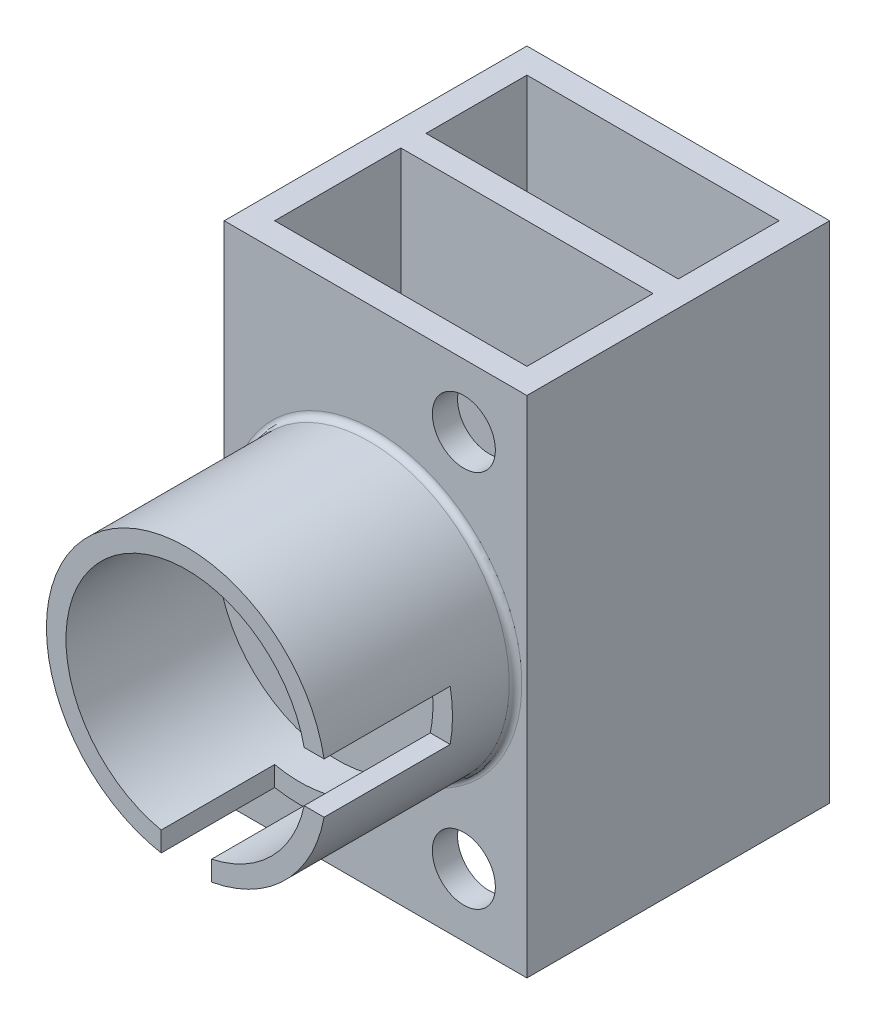
ISO-10303-21;
HEADER;
FILE_DESCRIPTION(('STEP AP214'),'2;1');
FILE_NAME('part.step','',(''),(''),'','','');
FILE_SCHEMA(('AUTOMOTIVE_DESIGN { 1 0 10303 214 1 1 1 1 }'));
ENDSEC;
DATA;
#1=APPLICATION_CONTEXT('core data for automotive mechanical design processes');
#2=APPLICATION_PROTOCOL_DEFINITION('international standard','automotive_design',2000,#1);
#3=PRODUCT_CONTEXT('',#1,'mechanical');
#4=PRODUCT('Part','Part','',(#3));
#5=PRODUCT_RELATED_PRODUCT_CATEGORY('part','',(#4));
#6=PRODUCT_DEFINITION_FORMATION('','',#4);
#7=PRODUCT_DEFINITION_CONTEXT('part definition',#1,'design');
#8=PRODUCT_DEFINITION('design','',#6,#7);
#9=PRODUCT_DEFINITION_SHAPE('','',#8);
#10=(LENGTH_UNIT() NAMED_UNIT(*) SI_UNIT(.MILLI.,.METRE.));
#11=(NAMED_UNIT(*) PLANE_ANGLE_UNIT() SI_UNIT($,.RADIAN.));
#12=(NAMED_UNIT(*) SI_UNIT($,.STERADIAN.) SOLID_ANGLE_UNIT());
#13=UNCERTAINTY_MEASURE_WITH_UNIT(LENGTH_MEASURE(1.E-05),#10,'distance_accuracy_value','');
#14=(GEOMETRIC_REPRESENTATION_CONTEXT(3) GLOBAL_UNCERTAINTY_ASSIGNED_CONTEXT((#13)) GLOBAL_UNIT_ASSIGNED_CONTEXT((#10,
#11,#12)) REPRESENTATION_CONTEXT('',''));
#15=CARTESIAN_POINT('',(0.,0.,0.));
#16=DIRECTION('',(0.,0.,1.));
#17=DIRECTION('',(1.,0.,0.));
#18=AXIS2_PLACEMENT_3D('',#15,#16,#17);
#19=CARTESIAN_POINT('',(0.,20.,27.));
#20=DIRECTION('',(0.,0.,-1.));
#21=DIRECTION('',(-1.,0.,0.));
#22=AXIS2_PLACEMENT_3D('',#19,#20,#21);
#23=CYLINDRICAL_SURFACE('',#22,11.1);
#24=CARTESIAN_POINT('',(0.,20.,12.5));
#25=DIRECTION('',(0.,0.,-1.));
#26=DIRECTION('',(-1.,0.,0.));
#27=AXIS2_PLACEMENT_3D('',#24,#25,#26);
#28=CIRCLE('',#27,11.1);
#29=CARTESIAN_POINT('',(-11.1,20.,12.5));
#30=VERTEX_POINT('',#29);
#31=EDGE_CURVE('E382',#30,#30,#28,.F.);
#32=ORIENTED_EDGE('',*,*,#31,.T.);
#33=EDGE_LOOP('',(#32));
#34=FACE_BOUND('',#33,.T.);
#35=CARTESIAN_POINT('',(0.,20.,18.));
#36=DIRECTION('',(0.,0.,1.));
#37=DIRECTION('',(1.,0.,0.));
#38=AXIS2_PLACEMENT_3D('',#35,#36,#37);
#39=CIRCLE('',#38,11.1);
#40=CARTESIAN_POINT('',(-2.,9.08166679387371,18.));
#41=VERTEX_POINT('',#40);
#42=CARTESIAN_POINT('',(2.,9.0816667938737,18.));
#43=VERTEX_POINT('',#42);
#44=EDGE_CURVE('E199',#41,#43,#39,.T.);
#45=ORIENTED_EDGE('',*,*,#44,.F.);
#46=DIRECTION('',(0.,0.,-1.));
#47=VECTOR('',#46,1.);
#48=CARTESIAN_POINT('',(-2.,9.08166679387371,27.));
#49=LINE('',#48,#47);
#50=CARTESIAN_POINT('',(-2.,9.08166679387371,27.));
#51=VERTEX_POINT('',#50);
#52=EDGE_CURVE('E190',#51,#41,#49,.T.);
#53=ORIENTED_EDGE('',*,*,#52,.F.);
#54=CARTESIAN_POINT('',(0.,20.,27.));
#55=DIRECTION('',(0.,0.,1.));
#56=DIRECTION('',(1.,0.,0.));
#57=AXIS2_PLACEMENT_3D('',#54,#55,#56);
#58=CIRCLE('',#57,11.1);
#59=CARTESIAN_POINT('',(10.9183332061263,22.,27.));
#60=VERTEX_POINT('',#59);
#61=EDGE_CURVE('E290',#60,#51,#58,.T.);
#62=ORIENTED_EDGE('',*,*,#61,.F.);
#63=DIRECTION('',(0.,0.,-1.));
#64=VECTOR('',#63,1.);
#65=CARTESIAN_POINT('',(10.9183332061263,22.,27.));
#66=LINE('',#65,#64);
#67=CARTESIAN_POINT('',(10.9183332061263,22.,17.));
#68=VERTEX_POINT('',#67);
#69=EDGE_CURVE('E244',#60,#68,#66,.T.);
#70=ORIENTED_EDGE('',*,*,#69,.T.);
#71=CARTESIAN_POINT('',(0.,20.,17.));
#72=DIRECTION('',(0.,0.,-1.));
#73=DIRECTION('',(-1.,0.,0.));
#74=AXIS2_PLACEMENT_3D('',#71,#72,#73);
#75=CIRCLE('',#74,11.1);
#76=CARTESIAN_POINT('',(10.9183332061263,18.,17.));
#77=VERTEX_POINT('',#76);
#78=EDGE_CURVE('E238',#68,#77,#75,.T.);
#79=ORIENTED_EDGE('',*,*,#78,.T.);
#80=DIRECTION('',(0.,0.,-1.));
#81=VECTOR('',#80,1.);
#82=CARTESIAN_POINT('',(10.9183332061263,18.,27.));
#83=LINE('',#82,#81);
#84=CARTESIAN_POINT('',(10.9183332061263,18.,27.));
#85=VERTEX_POINT('',#84);
#86=EDGE_CURVE('E234',#77,#85,#83,.F.);
#87=ORIENTED_EDGE('',*,*,#86,.T.);
#88=CARTESIAN_POINT('',(2.,9.08166679387371,27.));
#89=VERTEX_POINT('',#88);
#90=EDGE_CURVE('E285',#89,#85,#58,.T.);
#91=ORIENTED_EDGE('',*,*,#90,.F.);
#92=DIRECTION('',(0.,0.,-1.));
#93=VECTOR('',#92,1.);
#94=CARTESIAN_POINT('',(2.,9.08166679387371,27.));
#95=LINE('',#94,#93);
#96=EDGE_CURVE('E213',#43,#89,#95,.F.);
#97=ORIENTED_EDGE('',*,*,#96,.F.);
#98=EDGE_LOOP('',(#45,#53,#62,#70,#79,#87,#91,#97));
#99=FACE_BOUND('',#98,.T.);
#100=ADVANCED_FACE('F53',(#34,#99),#23,.T.);
#101=CARTESIAN_POINT('',(0.,20.,27.));
#102=DIRECTION('',(0.,0.,1.));
#103=DIRECTION('',(1.,0.,0.));
#104=AXIS2_PLACEMENT_3D('',#101,#102,#103);
#105=PLANE('',#104);
#106=CARTESIAN_POINT('',(0.,20.,27.));
#107=DIRECTION('',(0.,0.,1.));
#108=DIRECTION('',(1.,0.,0.));
#109=AXIS2_PLACEMENT_3D('',#106,#107,#108);
#110=CIRCLE('',#109,9.55);
#111=CARTESIAN_POINT('',(2.,10.6617721167236,27.));
#112=VERTEX_POINT('',#111);
#113=CARTESIAN_POINT('',(9.33822788327636,18.,27.));
#114=VERTEX_POINT('',#113);
#115=EDGE_CURVE('E269',#112,#114,#110,.T.);
#116=ORIENTED_EDGE('',*,*,#115,.F.);
#117=DIRECTION('',(0.,-1.,0.));
#118=VECTOR('',#117,1.);
#119=CARTESIAN_POINT('',(2.,20.,27.));
#120=LINE('',#119,#118);
#121=EDGE_CURVE('E215',#112,#89,#120,.T.);
#122=ORIENTED_EDGE('',*,*,#121,.T.);
#123=ORIENTED_EDGE('',*,*,#90,.T.);
#124=DIRECTION('',(1.,0.,0.));
#125=VECTOR('',#124,1.);
#126=CARTESIAN_POINT('',(0.,18.,27.));
#127=LINE('',#126,#125);
#128=EDGE_CURVE('E228',#114,#85,#127,.T.);
#129=ORIENTED_EDGE('',*,*,#128,.F.);
#130=EDGE_LOOP('',(#116,#122,#123,#129));
#131=FACE_BOUND('',#130,.T.);
#132=ADVANCED_FACE('F418',(#131),#105,.T.);
#133=ORIENTED_EDGE('',*,*,#61,.T.);
#134=DIRECTION('',(0.,1.,0.));
#135=VECTOR('',#134,1.);
#136=CARTESIAN_POINT('',(-2.,20.,27.));
#137=LINE('',#136,#135);
#138=CARTESIAN_POINT('',(-2.,10.6617721167236,27.));
#139=VERTEX_POINT('',#138);
#140=EDGE_CURVE('E193',#51,#139,#137,.T.);
#141=ORIENTED_EDGE('',*,*,#140,.T.);
#142=CARTESIAN_POINT('',(9.33822788327636,22.,27.));
#143=VERTEX_POINT('',#142);
#144=EDGE_CURVE('E286',#143,#139,#110,.T.);
#145=ORIENTED_EDGE('',*,*,#144,.F.);
#146=DIRECTION('',(-1.,0.,0.));
#147=VECTOR('',#146,1.);
#148=CARTESIAN_POINT('',(0.,22.,27.));
#149=LINE('',#148,#147);
#150=EDGE_CURVE('E241',#60,#143,#149,.T.);
#151=ORIENTED_EDGE('',*,*,#150,.F.);
#152=EDGE_LOOP('',(#133,#141,#145,#151));
#153=FACE_BOUND('',#152,.T.);
#154=ADVANCED_FACE('F426',(#153),#105,.T.);
#155=CARTESIAN_POINT('',(0.,20.,15.));
#156=DIRECTION('',(0.,0.,1.));
#157=DIRECTION('',(1.,0.,0.));
#158=AXIS2_PLACEMENT_3D('',#155,#156,#157);
#159=CYLINDRICAL_SURFACE('',#158,9.55);
#160=CARTESIAN_POINT('',(0.,20.,15.));
#161=DIRECTION('',(0.,0.,1.));
#162=DIRECTION('',(1.,0.,0.));
#163=AXIS2_PLACEMENT_3D('',#160,#161,#162);
#164=CIRCLE('',#163,9.55);
#165=CARTESIAN_POINT('',(9.55,20.,15.));
#166=VERTEX_POINT('',#165);
#167=EDGE_CURVE('E281',#166,#166,#164,.T.);
#168=ORIENTED_EDGE('',*,*,#167,.F.);
#169=EDGE_LOOP('',(#168));
#170=FACE_BOUND('',#169,.T.);
#171=DIRECTION('',(0.,0.,1.));
#172=VECTOR('',#171,1.);
#173=CARTESIAN_POINT('',(2.,10.6617721167236,15.));
#174=LINE('',#173,#172);
#175=CARTESIAN_POINT('',(2.,10.6617721167236,18.));
#176=VERTEX_POINT('',#175);
#177=EDGE_CURVE('E13',#112,#176,#174,.F.);
#178=ORIENTED_EDGE('',*,*,#177,.F.);
#179=ORIENTED_EDGE('',*,*,#115,.T.);
#180=DIRECTION('',(0.,0.,1.));
#181=VECTOR('',#180,1.);
#182=CARTESIAN_POINT('',(9.33822788327636,18.,15.));
#183=LINE('',#182,#181);
#184=CARTESIAN_POINT('',(9.33822788327636,18.,17.));
#185=VERTEX_POINT('',#184);
#186=EDGE_CURVE('E390',#114,#185,#183,.F.);
#187=ORIENTED_EDGE('',*,*,#186,.T.);
#188=CARTESIAN_POINT('',(0.,20.,17.));
#189=DIRECTION('',(0.,0.,-1.));
#190=DIRECTION('',(-1.,0.,0.));
#191=AXIS2_PLACEMENT_3D('',#188,#189,#190);
#192=CIRCLE('',#191,9.55);
#193=CARTESIAN_POINT('',(9.33822788327636,22.,17.));
#194=VERTEX_POINT('',#193);
#195=EDGE_CURVE('E394',#185,#194,#192,.F.);
#196=ORIENTED_EDGE('',*,*,#195,.T.);
#197=DIRECTION('',(0.,0.,1.));
#198=VECTOR('',#197,1.);
#199=CARTESIAN_POINT('',(9.33822788327636,22.,15.));
#200=LINE('',#199,#198);
#201=EDGE_CURVE('E398',#194,#143,#200,.T.);
#202=ORIENTED_EDGE('',*,*,#201,.T.);
#203=ORIENTED_EDGE('',*,*,#144,.T.);
#204=DIRECTION('',(0.,0.,1.));
#205=VECTOR('',#204,1.);
#206=CARTESIAN_POINT('',(-2.,10.6617721167236,15.));
#207=LINE('',#206,#205);
#208=CARTESIAN_POINT('',(-2.,10.6617721167236,18.));
#209=VERTEX_POINT('',#208);
#210=EDGE_CURVE('E402',#209,#139,#207,.T.);
#211=ORIENTED_EDGE('',*,*,#210,.F.);
#212=CARTESIAN_POINT('',(0.,20.,18.));
#213=DIRECTION('',(0.,0.,1.));
#214=DIRECTION('',(1.,0.,0.));
#215=AXIS2_PLACEMENT_3D('',#212,#213,#214);
#216=CIRCLE('',#215,9.55);
#217=EDGE_CURVE('E62',#176,#209,#216,.F.);
#218=ORIENTED_EDGE('',*,*,#217,.F.);
#219=EDGE_LOOP('',(#178,#179,#187,#196,#202,#203,#211,#218));
#220=FACE_BOUND('',#219,.T.);
#221=ADVANCED_FACE('F414',(#170,#220),#159,.F.);
#222=CARTESIAN_POINT('',(10.,40.,12.));
#223=DIRECTION('',(-1.,0.,0.));
#224=DIRECTION('',(0.,0.,1.));
#225=AXIS2_PLACEMENT_3D('',#222,#223,#224);
#226=PLANE('',#225);
#227=DIRECTION('',(0.,1.,0.));
#228=VECTOR('',#227,1.);
#229=CARTESIAN_POINT('',(10.,0.,-2.));
#230=LINE('',#229,#228);
#231=CARTESIAN_POINT('',(10.,0.,-2.));
#232=VERTEX_POINT('',#231);
#233=CARTESIAN_POINT('',(10.,40.,-2.));
#234=VERTEX_POINT('',#233);
#235=EDGE_CURVE('E270',#232,#234,#230,.T.);
#236=ORIENTED_EDGE('',*,*,#235,.T.);
#237=DIRECTION('',(0.,0.,-1.));
#238=VECTOR('',#237,1.);
#239=CARTESIAN_POINT('',(10.,40.,0.));
#240=LINE('',#239,#238);
#241=CARTESIAN_POINT('',(10.,40.,-10.));
#242=VERTEX_POINT('',#241);
#243=EDGE_CURVE('E320',#234,#242,#240,.T.);
#244=ORIENTED_EDGE('',*,*,#243,.T.);
#245=DIRECTION('',(0.,-1.,0.));
#246=VECTOR('',#245,1.);
#247=CARTESIAN_POINT('',(10.,40.,-10.));
#248=LINE('',#247,#246);
#249=CARTESIAN_POINT('',(10.,0.,-10.));
#250=VERTEX_POINT('',#249);
#251=EDGE_CURVE('E294',#242,#250,#248,.T.);
#252=ORIENTED_EDGE('',*,*,#251,.T.);
#253=DIRECTION('',(0.,0.,-1.));
#254=VECTOR('',#253,1.);
#255=CARTESIAN_POINT('',(10.,0.,0.));
#256=LINE('',#255,#254);
#257=EDGE_CURVE('E293',#232,#250,#256,.T.);
#258=ORIENTED_EDGE('',*,*,#257,.F.);
#259=EDGE_LOOP('',(#236,#244,#252,#258));
#260=FACE_BOUND('',#259,.T.);
#261=ADVANCED_FACE('F501',(#260),#226,.T.);
#262=CARTESIAN_POINT('',(-10.,40.,12.));
#263=DIRECTION('',(1.,0.,0.));
#264=DIRECTION('',(0.,0.,-1.));
#265=AXIS2_PLACEMENT_3D('',#262,#263,#264);
#266=PLANE('',#265);
#267=DIRECTION('',(0.,1.,0.));
#268=VECTOR('',#267,1.);
#269=CARTESIAN_POINT('',(-10.,0.,-2.));
#270=LINE('',#269,#268);
#271=CARTESIAN_POINT('',(-10.,0.,-2.));
#272=VERTEX_POINT('',#271);
#273=CARTESIAN_POINT('',(-10.,40.,-2.));
#274=VERTEX_POINT('',#273);
#275=EDGE_CURVE('E265',#272,#274,#270,.T.);
#276=ORIENTED_EDGE('',*,*,#275,.F.);
#277=DIRECTION('',(0.,0.,1.));
#278=VECTOR('',#277,1.);
#279=CARTESIAN_POINT('',(-10.,0.,0.));
#280=LINE('',#279,#278);
#281=CARTESIAN_POINT('',(-10.,0.,-10.));
#282=VERTEX_POINT('',#281);
#283=EDGE_CURVE('E321',#282,#272,#280,.T.);
#284=ORIENTED_EDGE('',*,*,#283,.F.);
#285=DIRECTION('',(0.,-1.,0.));
#286=VECTOR('',#285,1.);
#287=CARTESIAN_POINT('',(-10.,40.,-10.));
#288=LINE('',#287,#286);
#289=CARTESIAN_POINT('',(-10.,40.,-10.));
#290=VERTEX_POINT('',#289);
#291=EDGE_CURVE('E299',#290,#282,#288,.T.);
#292=ORIENTED_EDGE('',*,*,#291,.F.);
#293=DIRECTION('',(0.,0.,1.));
#294=VECTOR('',#293,1.);
#295=CARTESIAN_POINT('',(-10.,40.,0.));
#296=LINE('',#295,#294);
#297=EDGE_CURVE('E336',#290,#274,#296,.T.);
#298=ORIENTED_EDGE('',*,*,#297,.T.);
#299=EDGE_LOOP('',(#276,#284,#292,#298));
#300=FACE_BOUND('',#299,.T.);
#301=ADVANCED_FACE('F506',(#300),#266,.T.);
#302=CARTESIAN_POINT('',(0.,40.,0.));
#303=DIRECTION('',(0.,-1.,0.));
#304=DIRECTION('',(0.,0.,-1.));
#305=AXIS2_PLACEMENT_3D('',#302,#303,#304);
#306=PLANE('',#305);
#307=ORIENTED_EDGE('',*,*,#243,.F.);
#308=DIRECTION('',(-1.,0.,0.));
#309=VECTOR('',#308,1.);
#310=CARTESIAN_POINT('',(-10.,40.,-2.));
#311=LINE('',#310,#309);
#312=EDGE_CURVE('E254',#234,#274,#311,.T.);
#313=ORIENTED_EDGE('',*,*,#312,.T.);
#314=ORIENTED_EDGE('',*,*,#297,.F.);
#315=DIRECTION('',(-1.,0.,0.));
#316=VECTOR('',#315,1.);
#317=CARTESIAN_POINT('',(0.,40.,-10.));
#318=LINE('',#317,#316);
#319=EDGE_CURVE('E332',#242,#290,#318,.T.);
#320=ORIENTED_EDGE('',*,*,#319,.F.);
#321=EDGE_LOOP('',(#307,#313,#314,#320));
#322=FACE_BOUND('',#321,.T.);
#323=DIRECTION('',(0.,0.,-1.));
#324=VECTOR('',#323,1.);
#325=CARTESIAN_POINT('',(12.,40.,12.));
#326=LINE('',#325,#324);
#327=CARTESIAN_POINT('',(12.,40.,12.));
#328=VERTEX_POINT('',#327);
#329=CARTESIAN_POINT('',(12.,40.,-12.));
#330=VERTEX_POINT('',#329);
#331=EDGE_CURVE('E341',#328,#330,#326,.T.);
#332=ORIENTED_EDGE('',*,*,#331,.T.);
#333=DIRECTION('',(-1.,0.,0.));
#334=VECTOR('',#333,1.);
#335=CARTESIAN_POINT('',(-12.,40.,-12.));
#336=LINE('',#335,#334);
#337=CARTESIAN_POINT('',(-12.,40.,-12.));
#338=VERTEX_POINT('',#337);
#339=EDGE_CURVE('E345',#330,#338,#336,.T.);
#340=ORIENTED_EDGE('',*,*,#339,.T.);
#341=DIRECTION('',(0.,0.,1.));
#342=VECTOR('',#341,1.);
#343=CARTESIAN_POINT('',(-12.,40.,12.));
#344=LINE('',#343,#342);
#345=CARTESIAN_POINT('',(-12.,40.,12.));
#346=VERTEX_POINT('',#345);
#347=EDGE_CURVE('E349',#338,#346,#344,.T.);
#348=ORIENTED_EDGE('',*,*,#347,.T.);
#349=DIRECTION('',(1.,0.,0.));
#350=VECTOR('',#349,1.);
#351=CARTESIAN_POINT('',(-12.,40.,12.));
#352=LINE('',#351,#350);
#353=EDGE_CURVE('E352',#346,#328,#352,.T.);
#354=ORIENTED_EDGE('',*,*,#353,.T.);
#355=EDGE_LOOP('',(#332,#340,#348,#354));
#356=FACE_BOUND('',#355,.T.);
#357=CARTESIAN_POINT('',(10.,40.,10.));
#358=VERTEX_POINT('',#357);
#359=CARTESIAN_POINT('',(10.,40.,0.));
#360=VERTEX_POINT('',#359);
#361=EDGE_CURVE('E329',#358,#360,#240,.T.);
#362=ORIENTED_EDGE('',*,*,#361,.F.);
#363=DIRECTION('',(1.,0.,0.));
#364=VECTOR('',#363,1.);
#365=CARTESIAN_POINT('',(0.,40.,10.));
#366=LINE('',#365,#364);
#367=CARTESIAN_POINT('',(-10.,40.,10.));
#368=VERTEX_POINT('',#367);
#369=EDGE_CURVE('E304',#368,#358,#366,.T.);
#370=ORIENTED_EDGE('',*,*,#369,.F.);
#371=CARTESIAN_POINT('',(-10.,40.,0.));
#372=VERTEX_POINT('',#371);
#373=EDGE_CURVE('E335',#372,#368,#296,.T.);
#374=ORIENTED_EDGE('',*,*,#373,.F.);
#375=DIRECTION('',(1.,0.,0.));
#376=VECTOR('',#375,1.);
#377=CARTESIAN_POINT('',(-10.,40.,0.));
#378=LINE('',#377,#376);
#379=EDGE_CURVE('E248',#372,#360,#378,.T.);
#380=ORIENTED_EDGE('',*,*,#379,.T.);
#381=EDGE_LOOP('',(#362,#370,#374,#380));
#382=FACE_BOUND('',#381,.T.);
#383=ADVANCED_FACE('F471',(#322,#356,#382),#306,.F.);
#384=CARTESIAN_POINT('',(0.,0.,0.));
#385=DIRECTION('',(0.,-1.,0.));
#386=DIRECTION('',(0.,0.,-1.));
#387=AXIS2_PLACEMENT_3D('',#384,#385,#386);
#388=PLANE('',#387);
#389=DIRECTION('',(-1.,0.,0.));
#390=VECTOR('',#389,1.);
#391=CARTESIAN_POINT('',(-10.,0.,-2.));
#392=LINE('',#391,#390);
#393=EDGE_CURVE('E253',#232,#272,#392,.T.);
#394=ORIENTED_EDGE('',*,*,#393,.F.);
#395=ORIENTED_EDGE('',*,*,#257,.T.);
#396=DIRECTION('',(-1.,0.,0.));
#397=VECTOR('',#396,1.);
#398=CARTESIAN_POINT('',(0.,0.,-10.));
#399=LINE('',#398,#397);
#400=EDGE_CURVE('E315',#250,#282,#399,.T.);
#401=ORIENTED_EDGE('',*,*,#400,.T.);
#402=ORIENTED_EDGE('',*,*,#283,.T.);
#403=EDGE_LOOP('',(#394,#395,#401,#402));
#404=FACE_BOUND('',#403,.T.);
#405=DIRECTION('',(0.,0.,-1.));
#406=VECTOR('',#405,1.);
#407=CARTESIAN_POINT('',(12.,0.,12.));
#408=LINE('',#407,#406);
#409=CARTESIAN_POINT('',(12.,0.,12.));
#410=VERTEX_POINT('',#409);
#411=CARTESIAN_POINT('',(12.,0.,-12.));
#412=VERTEX_POINT('',#411);
#413=EDGE_CURVE('E298',#410,#412,#408,.T.);
#414=ORIENTED_EDGE('',*,*,#413,.F.);
#415=DIRECTION('',(1.,0.,0.));
#416=VECTOR('',#415,1.);
#417=CARTESIAN_POINT('',(-12.,0.,12.));
#418=LINE('',#417,#416);
#419=CARTESIAN_POINT('',(-12.,0.,12.));
#420=VERTEX_POINT('',#419);
#421=EDGE_CURVE('E346',#420,#410,#418,.T.);
#422=ORIENTED_EDGE('',*,*,#421,.F.);
#423=DIRECTION('',(0.,0.,1.));
#424=VECTOR('',#423,1.);
#425=CARTESIAN_POINT('',(-12.,0.,12.));
#426=LINE('',#425,#424);
#427=CARTESIAN_POINT('',(-12.,0.,-12.));
#428=VERTEX_POINT('',#427);
#429=EDGE_CURVE('E362',#428,#420,#426,.T.);
#430=ORIENTED_EDGE('',*,*,#429,.F.);
#431=DIRECTION('',(-1.,0.,0.));
#432=VECTOR('',#431,1.);
#433=CARTESIAN_POINT('',(-12.,0.,-12.));
#434=LINE('',#433,#432);
#435=EDGE_CURVE('E359',#412,#428,#434,.T.);
#436=ORIENTED_EDGE('',*,*,#435,.F.);
#437=EDGE_LOOP('',(#414,#422,#430,#436));
#438=FACE_BOUND('',#437,.T.);
#439=DIRECTION('',(1.,0.,0.));
#440=VECTOR('',#439,1.);
#441=CARTESIAN_POINT('',(0.,0.,10.));
#442=LINE('',#441,#440);
#443=CARTESIAN_POINT('',(-10.,0.,10.));
#444=VERTEX_POINT('',#443);
#445=CARTESIAN_POINT('',(10.,0.,10.));
#446=VERTEX_POINT('',#445);
#447=EDGE_CURVE('E316',#444,#446,#442,.T.);
#448=ORIENTED_EDGE('',*,*,#447,.T.);
#449=CARTESIAN_POINT('',(10.,0.,0.));
#450=VERTEX_POINT('',#449);
#451=EDGE_CURVE('E311',#446,#450,#256,.T.);
#452=ORIENTED_EDGE('',*,*,#451,.T.);
#453=DIRECTION('',(1.,0.,0.));
#454=VECTOR('',#453,1.);
#455=CARTESIAN_POINT('',(-10.,0.,0.));
#456=LINE('',#455,#454);
#457=CARTESIAN_POINT('',(-10.,0.,0.));
#458=VERTEX_POINT('',#457);
#459=EDGE_CURVE('E249',#458,#450,#456,.T.);
#460=ORIENTED_EDGE('',*,*,#459,.F.);
#461=EDGE_CURVE('E325',#458,#444,#280,.T.);
#462=ORIENTED_EDGE('',*,*,#461,.T.);
#463=EDGE_LOOP('',(#448,#452,#460,#462));
#464=FACE_BOUND('',#463,.T.);
#465=ADVANCED_FACE('F464',(#404,#438,#464),#388,.T.);
#466=CARTESIAN_POINT('',(12.,40.,12.));
#467=DIRECTION('',(-1.,0.,0.));
#468=DIRECTION('',(0.,0.,1.));
#469=AXIS2_PLACEMENT_3D('',#466,#467,#468);
#470=PLANE('',#469);
#471=ORIENTED_EDGE('',*,*,#413,.T.);
#472=DIRECTION('',(0.,-1.,0.));
#473=VECTOR('',#472,1.);
#474=CARTESIAN_POINT('',(12.,40.,-12.));
#475=LINE('',#474,#473);
#476=EDGE_CURVE('E378',#330,#412,#475,.T.);
#477=ORIENTED_EDGE('',*,*,#476,.F.);
#478=ORIENTED_EDGE('',*,*,#331,.F.);
#479=DIRECTION('',(0.,-1.,0.));
#480=VECTOR('',#479,1.);
#481=CARTESIAN_POINT('',(12.,40.,12.));
#482=LINE('',#481,#480);
#483=EDGE_CURVE('E355',#328,#410,#482,.T.);
#484=ORIENTED_EDGE('',*,*,#483,.T.);
#485=EDGE_LOOP('',(#471,#477,#478,#484));
#486=FACE_BOUND('',#485,.T.);
#487=ADVANCED_FACE('F513',(#486),#470,.F.);
#488=CARTESIAN_POINT('',(-12.,40.,-12.));
#489=DIRECTION('',(0.,0.,1.));
#490=DIRECTION('',(1.,0.,0.));
#491=AXIS2_PLACEMENT_3D('',#488,#489,#490);
#492=PLANE('',#491);
#493=ORIENTED_EDGE('',*,*,#435,.T.);
#494=DIRECTION('',(0.,-1.,0.));
#495=VECTOR('',#494,1.);
#496=CARTESIAN_POINT('',(-12.,40.,-12.));
#497=LINE('',#496,#495);
#498=EDGE_CURVE('E374',#338,#428,#497,.T.);
#499=ORIENTED_EDGE('',*,*,#498,.F.);
#500=ORIENTED_EDGE('',*,*,#339,.F.);
#501=ORIENTED_EDGE('',*,*,#476,.T.);
#502=EDGE_LOOP('',(#493,#499,#500,#501));
#503=FACE_BOUND('',#502,.T.);
#504=ADVANCED_FACE('F521',(#503),#492,.F.);
#505=CARTESIAN_POINT('',(-12.,40.,12.));
#506=DIRECTION('',(1.,0.,0.));
#507=DIRECTION('',(0.,0.,-1.));
#508=AXIS2_PLACEMENT_3D('',#505,#506,#507);
#509=PLANE('',#508);
#510=ORIENTED_EDGE('',*,*,#429,.T.);
#511=DIRECTION('',(0.,-1.,0.));
#512=VECTOR('',#511,1.);
#513=CARTESIAN_POINT('',(-12.,40.,12.));
#514=LINE('',#513,#512);
#515=EDGE_CURVE('E370',#346,#420,#514,.T.);
#516=ORIENTED_EDGE('',*,*,#515,.F.);
#517=ORIENTED_EDGE('',*,*,#347,.F.);
#518=ORIENTED_EDGE('',*,*,#498,.T.);
#519=EDGE_LOOP('',(#510,#516,#517,#518));
#520=FACE_BOUND('',#519,.T.);
#521=ADVANCED_FACE('F517',(#520),#509,.F.);
#522=CARTESIAN_POINT('',(-12.,40.,12.));
#523=DIRECTION('',(0.,0.,-1.));
#524=DIRECTION('',(-1.,0.,0.));
#525=AXIS2_PLACEMENT_3D('',#522,#523,#524);
#526=PLANE('',#525);
#527=CARTESIAN_POINT('',(7.,5.,12.));
#528=DIRECTION('',(0.,0.,-1.));
#529=DIRECTION('',(1.,0.,0.));
#530=AXIS2_PLACEMENT_3D('',#527,#528,#529);
#531=CIRCLE('',#530,2.5);
#532=CARTESIAN_POINT('',(9.5,5.,12.));
#533=VERTEX_POINT('',#532);
#534=EDGE_CURVE('E435',#533,#533,#531,.T.);
#535=ORIENTED_EDGE('',*,*,#534,.T.);
#536=EDGE_LOOP('',(#535));
#537=FACE_BOUND('',#536,.T.);
#538=CARTESIAN_POINT('',(7.,35.,12.));
#539=DIRECTION('',(0.,0.,1.));
#540=DIRECTION('',(1.,0.,0.));
#541=AXIS2_PLACEMENT_3D('',#538,#539,#540);
#542=CIRCLE('',#541,2.5);
#543=CARTESIAN_POINT('',(9.5,35.,12.));
#544=VERTEX_POINT('',#543);
#545=EDGE_CURVE('E209',#544,#544,#542,.T.);
#546=ORIENTED_EDGE('',*,*,#545,.F.);
#547=EDGE_LOOP('',(#546));
#548=FACE_BOUND('',#547,.T.);
#549=CARTESIAN_POINT('',(0.,20.,12.));
#550=DIRECTION('',(0.,0.,-1.));
#551=DIRECTION('',(-1.,0.,0.));
#552=AXIS2_PLACEMENT_3D('',#549,#550,#551);
#553=CIRCLE('',#552,11.6);
#554=CARTESIAN_POINT('',(-11.6,20.,12.));
#555=VERTEX_POINT('',#554);
#556=EDGE_CURVE('E386',#555,#555,#553,.T.);
#557=ORIENTED_EDGE('',*,*,#556,.T.);
#558=EDGE_LOOP('',(#557));
#559=FACE_BOUND('',#558,.T.);
#560=ORIENTED_EDGE('',*,*,#421,.T.);
#561=ORIENTED_EDGE('',*,*,#483,.F.);
#562=ORIENTED_EDGE('',*,*,#353,.F.);
#563=ORIENTED_EDGE('',*,*,#515,.T.);
#564=EDGE_LOOP('',(#560,#561,#562,#563));
#565=FACE_BOUND('',#564,.T.);
#566=ADVANCED_FACE('F500',(#537,#548,#559,#565),#526,.F.);
#567=DIRECTION('',(0.,1.,0.));
#568=VECTOR('',#567,1.);
#569=CARTESIAN_POINT('',(10.,0.,0.));
#570=LINE('',#569,#568);
#571=EDGE_CURVE('E274',#450,#360,#570,.T.);
#572=ORIENTED_EDGE('',*,*,#571,.F.);
#573=ORIENTED_EDGE('',*,*,#451,.F.);
#574=DIRECTION('',(0.,-1.,0.));
#575=VECTOR('',#574,1.);
#576=CARTESIAN_POINT('',(10.,40.,10.));
#577=LINE('',#576,#575);
#578=EDGE_CURVE('E300',#358,#446,#577,.T.);
#579=ORIENTED_EDGE('',*,*,#578,.F.);
#580=ORIENTED_EDGE('',*,*,#361,.T.);
#581=EDGE_LOOP('',(#572,#573,#579,#580));
#582=FACE_BOUND('',#581,.T.);
#583=ADVANCED_FACE('F473',(#582),#226,.T.);
#584=CARTESIAN_POINT('',(-12.,40.,-10.));
#585=DIRECTION('',(0.,0.,1.));
#586=DIRECTION('',(1.,0.,0.));
#587=AXIS2_PLACEMENT_3D('',#584,#585,#586);
#588=PLANE('',#587);
#589=ORIENTED_EDGE('',*,*,#400,.F.);
#590=ORIENTED_EDGE('',*,*,#251,.F.);
#591=ORIENTED_EDGE('',*,*,#319,.T.);
#592=ORIENTED_EDGE('',*,*,#291,.T.);
#593=EDGE_LOOP('',(#589,#590,#591,#592));
#594=FACE_BOUND('',#593,.T.);
#595=ADVANCED_FACE('F499',(#594),#588,.T.);
#596=DIRECTION('',(0.,1.,0.));
#597=VECTOR('',#596,1.);
#598=CARTESIAN_POINT('',(-10.,0.,0.));
#599=LINE('',#598,#597);
#600=EDGE_CURVE('E258',#458,#372,#599,.T.);
#601=ORIENTED_EDGE('',*,*,#600,.T.);
#602=ORIENTED_EDGE('',*,*,#373,.T.);
#603=DIRECTION('',(0.,-1.,0.));
#604=VECTOR('',#603,1.);
#605=CARTESIAN_POINT('',(-10.,40.,10.));
#606=LINE('',#605,#604);
#607=EDGE_CURVE('E303',#368,#444,#606,.T.);
#608=ORIENTED_EDGE('',*,*,#607,.T.);
#609=ORIENTED_EDGE('',*,*,#461,.F.);
#610=EDGE_LOOP('',(#601,#602,#608,#609));
#611=FACE_BOUND('',#610,.T.);
#612=ADVANCED_FACE('F454',(#611),#266,.T.);
#613=CARTESIAN_POINT('',(-12.,40.,10.));
#614=DIRECTION('',(0.,0.,-1.));
#615=DIRECTION('',(-1.,0.,0.));
#616=AXIS2_PLACEMENT_3D('',#613,#614,#615);
#617=PLANE('',#616);
#618=CARTESIAN_POINT('',(7.,5.,10.));
#619=DIRECTION('',(0.,0.,-1.));
#620=DIRECTION('',(-1.,0.,0.));
#621=AXIS2_PLACEMENT_3D('',#618,#619,#620);
#622=CIRCLE('',#621,2.5);
#623=CARTESIAN_POINT('',(4.5,5.,10.));
#624=VERTEX_POINT('',#623);
#625=EDGE_CURVE('E442',#624,#624,#622,.T.);
#626=ORIENTED_EDGE('',*,*,#625,.F.);
#627=EDGE_LOOP('',(#626));
#628=FACE_BOUND('',#627,.T.);
#629=CARTESIAN_POINT('',(7.,35.,10.));
#630=DIRECTION('',(0.,0.,-1.));
#631=DIRECTION('',(-1.,0.,0.));
#632=AXIS2_PLACEMENT_3D('',#629,#630,#631);
#633=CIRCLE('',#632,2.5);
#634=CARTESIAN_POINT('',(4.5,35.,10.));
#635=VERTEX_POINT('',#634);
#636=EDGE_CURVE('E431',#635,#635,#633,.F.);
#637=ORIENTED_EDGE('',*,*,#636,.T.);
#638=EDGE_LOOP('',(#637));
#639=FACE_BOUND('',#638,.T.);
#640=ORIENTED_EDGE('',*,*,#447,.F.);
#641=ORIENTED_EDGE('',*,*,#607,.F.);
#642=ORIENTED_EDGE('',*,*,#369,.T.);
#643=ORIENTED_EDGE('',*,*,#578,.T.);
#644=EDGE_LOOP('',(#640,#641,#642,#643));
#645=FACE_BOUND('',#644,.T.);
#646=ADVANCED_FACE('F450',(#628,#639,#645),#617,.T.);
#647=CARTESIAN_POINT('',(0.,20.,15.));
#648=DIRECTION('',(0.,0.,1.));
#649=DIRECTION('',(1.,0.,0.));
#650=AXIS2_PLACEMENT_3D('',#647,#648,#649);
#651=PLANE('',#650);
#652=ORIENTED_EDGE('',*,*,#167,.T.);
#653=EDGE_LOOP('',(#652));
#654=FACE_BOUND('',#653,.T.);
#655=ADVANCED_FACE('F453',(#654),#651,.T.);
#656=CARTESIAN_POINT('',(0.,20.,12.5));
#657=DIRECTION('',(0.,0.,-1.));
#658=DIRECTION('',(-1.,0.,0.));
#659=AXIS2_PLACEMENT_3D('',#656,#657,#658);
#660=TOROIDAL_SURFACE('',#659,11.6,0.5);
#661=ORIENTED_EDGE('',*,*,#556,.F.);
#662=EDGE_LOOP('',(#661));
#663=FACE_BOUND('',#662,.T.);
#664=ORIENTED_EDGE('',*,*,#31,.F.);
#665=EDGE_LOOP('',(#664));
#666=FACE_BOUND('',#665,.T.);
#667=ADVANCED_FACE('F55',(#663,#666),#660,.F.);
#668=CARTESIAN_POINT('',(-10.,0.,-2.));
#669=DIRECTION('',(0.,0.,-1.));
#670=DIRECTION('',(-1.,0.,0.));
#671=AXIS2_PLACEMENT_3D('',#668,#669,#670);
#672=PLANE('',#671);
#673=ORIENTED_EDGE('',*,*,#312,.F.);
#674=ORIENTED_EDGE('',*,*,#235,.F.);
#675=ORIENTED_EDGE('',*,*,#393,.T.);
#676=ORIENTED_EDGE('',*,*,#275,.T.);
#677=EDGE_LOOP('',(#673,#674,#675,#676));
#678=FACE_BOUND('',#677,.T.);
#679=ADVANCED_FACE('F478',(#678),#672,.T.);
#680=CARTESIAN_POINT('',(-10.,0.,0.));
#681=DIRECTION('',(0.,0.,1.));
#682=DIRECTION('',(1.,0.,0.));
#683=AXIS2_PLACEMENT_3D('',#680,#681,#682);
#684=PLANE('',#683);
#685=ORIENTED_EDGE('',*,*,#379,.F.);
#686=ORIENTED_EDGE('',*,*,#600,.F.);
#687=ORIENTED_EDGE('',*,*,#459,.T.);
#688=ORIENTED_EDGE('',*,*,#571,.T.);
#689=EDGE_LOOP('',(#685,#686,#687,#688));
#690=FACE_BOUND('',#689,.T.);
#691=ADVANCED_FACE('F475',(#690),#684,.T.);
#692=CARTESIAN_POINT('',(3.10000000000001,22.,17.));
#693=DIRECTION('',(0.,1.,0.));
#694=DIRECTION('',(0.,0.,1.));
#695=AXIS2_PLACEMENT_3D('',#692,#693,#694);
#696=PLANE('',#695);
#697=ORIENTED_EDGE('',*,*,#150,.T.);
#698=ORIENTED_EDGE('',*,*,#201,.F.);
#699=DIRECTION('',(1.,0.,0.));
#700=VECTOR('',#699,1.);
#701=CARTESIAN_POINT('',(3.10000000000001,22.,17.));
#702=LINE('',#701,#700);
#703=EDGE_CURVE('E224',#194,#68,#702,.T.);
#704=ORIENTED_EDGE('',*,*,#703,.T.);
#705=ORIENTED_EDGE('',*,*,#69,.F.);
#706=EDGE_LOOP('',(#697,#698,#704,#705));
#707=FACE_BOUND('',#706,.T.);
#708=ADVANCED_FACE('F477',(#707),#696,.F.);
#709=CARTESIAN_POINT('',(3.10000000000001,22.,17.));
#710=DIRECTION('',(0.,0.,-1.));
#711=DIRECTION('',(-1.,0.,0.));
#712=AXIS2_PLACEMENT_3D('',#709,#710,#711);
#713=PLANE('',#712);
#714=ORIENTED_EDGE('',*,*,#703,.F.);
#715=ORIENTED_EDGE('',*,*,#195,.F.);
#716=DIRECTION('',(1.,0.,0.));
#717=VECTOR('',#716,1.);
#718=CARTESIAN_POINT('',(3.10000000000001,18.,17.));
#719=LINE('',#718,#717);
#720=EDGE_CURVE('E77',#185,#77,#719,.T.);
#721=ORIENTED_EDGE('',*,*,#720,.T.);
#722=ORIENTED_EDGE('',*,*,#78,.F.);
#723=EDGE_LOOP('',(#714,#715,#721,#722));
#724=FACE_BOUND('',#723,.T.);
#725=ADVANCED_FACE('F421',(#724),#713,.F.);
#726=CARTESIAN_POINT('',(3.10000000000001,18.,17.));
#727=DIRECTION('',(0.,-1.,0.));
#728=DIRECTION('',(0.,0.,-1.));
#729=AXIS2_PLACEMENT_3D('',#726,#727,#728);
#730=PLANE('',#729);
#731=ORIENTED_EDGE('',*,*,#720,.F.);
#732=ORIENTED_EDGE('',*,*,#186,.F.);
#733=ORIENTED_EDGE('',*,*,#128,.T.);
#734=ORIENTED_EDGE('',*,*,#86,.F.);
#735=EDGE_LOOP('',(#731,#732,#733,#734));
#736=FACE_BOUND('',#735,.T.);
#737=ADVANCED_FACE('F417',(#736),#730,.F.);
#738=CARTESIAN_POINT('',(2.,16.9,18.));
#739=DIRECTION('',(-1.,0.,0.));
#740=DIRECTION('',(0.,0.,1.));
#741=AXIS2_PLACEMENT_3D('',#738,#739,#740);
#742=PLANE('',#741);
#743=ORIENTED_EDGE('',*,*,#96,.T.);
#744=ORIENTED_EDGE('',*,*,#121,.F.);
#745=ORIENTED_EDGE('',*,*,#177,.T.);
#746=DIRECTION('',(0.,-1.,0.));
#747=VECTOR('',#746,1.);
#748=CARTESIAN_POINT('',(2.,16.9,18.));
#749=LINE('',#748,#747);
#750=EDGE_CURVE('E208',#176,#43,#749,.T.);
#751=ORIENTED_EDGE('',*,*,#750,.T.);
#752=EDGE_LOOP('',(#743,#744,#745,#751));
#753=FACE_BOUND('',#752,.T.);
#754=ADVANCED_FACE('F618',(#753),#742,.T.);
#755=CARTESIAN_POINT('',(-2.,16.9,18.));
#756=DIRECTION('',(0.,0.,1.));
#757=DIRECTION('',(1.,0.,0.));
#758=AXIS2_PLACEMENT_3D('',#755,#756,#757);
#759=PLANE('',#758);
#760=ORIENTED_EDGE('',*,*,#44,.T.);
#761=ORIENTED_EDGE('',*,*,#750,.F.);
#762=ORIENTED_EDGE('',*,*,#217,.T.);
#763=DIRECTION('',(0.,-1.,0.));
#764=VECTOR('',#763,1.);
#765=CARTESIAN_POINT('',(-2.,16.9,18.));
#766=LINE('',#765,#764);
#767=EDGE_CURVE('E69',#209,#41,#766,.T.);
#768=ORIENTED_EDGE('',*,*,#767,.T.);
#769=EDGE_LOOP('',(#760,#761,#762,#768));
#770=FACE_BOUND('',#769,.T.);
#771=ADVANCED_FACE('F202',(#770),#759,.T.);
#772=CARTESIAN_POINT('',(-2.,16.9,18.));
#773=DIRECTION('',(1.,0.,0.));
#774=DIRECTION('',(0.,0.,-1.));
#775=AXIS2_PLACEMENT_3D('',#772,#773,#774);
#776=PLANE('',#775);
#777=ORIENTED_EDGE('',*,*,#52,.T.);
#778=ORIENTED_EDGE('',*,*,#767,.F.);
#779=ORIENTED_EDGE('',*,*,#210,.T.);
#780=ORIENTED_EDGE('',*,*,#140,.F.);
#781=EDGE_LOOP('',(#777,#778,#779,#780));
#782=FACE_BOUND('',#781,.T.);
#783=ADVANCED_FACE('F191',(#782),#776,.T.);
#784=CARTESIAN_POINT('',(7.,35.,-12.001));
#785=DIRECTION('',(0.,0.,1.));
#786=DIRECTION('',(1.,0.,0.));
#787=AXIS2_PLACEMENT_3D('',#784,#785,#786);
#788=CYLINDRICAL_SURFACE('',#787,2.5);
#789=ORIENTED_EDGE('',*,*,#636,.F.);
#790=EDGE_LOOP('',(#789));
#791=FACE_BOUND('',#790,.T.);
#792=ORIENTED_EDGE('',*,*,#545,.T.);
#793=EDGE_LOOP('',(#792));
#794=FACE_BOUND('',#793,.T.);
#795=ADVANCED_FACE('F670',(#791,#794),#788,.F.);
#796=CARTESIAN_POINT('',(7.,5.,-12.001));
#797=DIRECTION('',(0.,0.,1.));
#798=DIRECTION('',(1.,0.,0.));
#799=AXIS2_PLACEMENT_3D('',#796,#797,#798);
#800=CYLINDRICAL_SURFACE('',#799,2.5);
#801=ORIENTED_EDGE('',*,*,#625,.T.);
#802=EDGE_LOOP('',(#801));
#803=FACE_BOUND('',#802,.T.);
#804=ORIENTED_EDGE('',*,*,#534,.F.);
#805=EDGE_LOOP('',(#804));
#806=FACE_BOUND('',#805,.T.);
#807=ADVANCED_FACE('F447',(#803,#806),#800,.F.);
#808=CLOSED_SHELL('',(#100,#132,#154,#221,#261,#301,#383,#465,#487,#504,#521,#566,#583,#595,
#612,#646,#655,#667,#679,#691,#708,#725,#737,#754,#771,#783,#795,#807));
#809=MANIFOLD_SOLID_BREP('B2',#808);
#810=ADVANCED_BREP_SHAPE_REPRESENTATION('',(#18,#809),#14);
#811=SHAPE_DEFINITION_REPRESENTATION(#9,#810);
ENDSEC;
END-ISO-10303-21;
